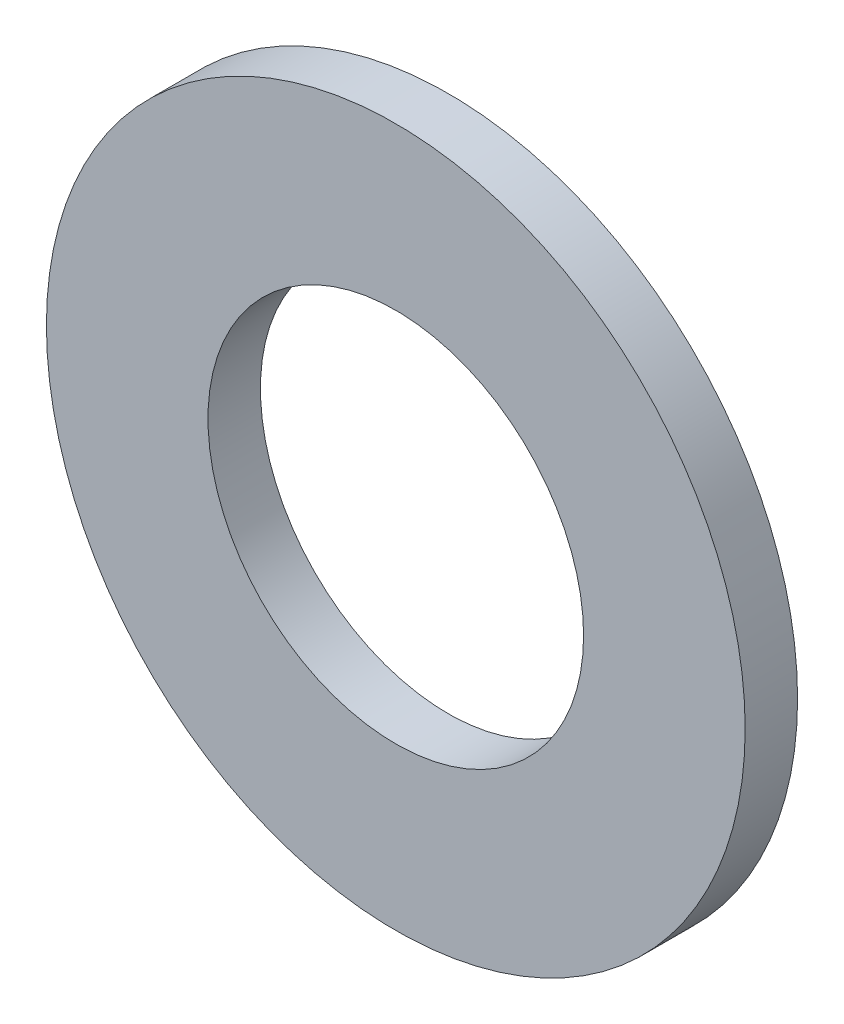
ISO-10303-21;
HEADER;
FILE_DESCRIPTION(('STEP AP214'),'2;1');
FILE_NAME('part.step','',(''),(''),'','','');
FILE_SCHEMA(('AUTOMOTIVE_DESIGN { 1 0 10303 214 1 1 1 1 }'));
ENDSEC;
DATA;
#1=APPLICATION_CONTEXT('core data for automotive mechanical design processes');
#2=APPLICATION_PROTOCOL_DEFINITION('international standard','automotive_design',2000,#1);
#3=PRODUCT_CONTEXT('',#1,'mechanical');
#4=PRODUCT('Part','Part','',(#3));
#5=PRODUCT_RELATED_PRODUCT_CATEGORY('part','',(#4));
#6=PRODUCT_DEFINITION_FORMATION('','',#4);
#7=PRODUCT_DEFINITION_CONTEXT('part definition',#1,'design');
#8=PRODUCT_DEFINITION('design','',#6,#7);
#9=PRODUCT_DEFINITION_SHAPE('','',#8);
#10=(LENGTH_UNIT() NAMED_UNIT(*) SI_UNIT(.MILLI.,.METRE.));
#11=(NAMED_UNIT(*) PLANE_ANGLE_UNIT() SI_UNIT($,.RADIAN.));
#12=(NAMED_UNIT(*) SI_UNIT($,.STERADIAN.) SOLID_ANGLE_UNIT());
#13=UNCERTAINTY_MEASURE_WITH_UNIT(LENGTH_MEASURE(1.E-05),#10,'distance_accuracy_value','');
#14=(GEOMETRIC_REPRESENTATION_CONTEXT(3) GLOBAL_UNCERTAINTY_ASSIGNED_CONTEXT((#13)) GLOBAL_UNIT_ASSIGNED_CONTEXT((#10,
#11,#12)) REPRESENTATION_CONTEXT('',''));
#15=CARTESIAN_POINT('',(0.,0.,0.));
#16=DIRECTION('',(0.,0.,1.));
#17=DIRECTION('',(1.,0.,0.));
#18=AXIS2_PLACEMENT_3D('',#15,#16,#17);
#19=CARTESIAN_POINT('',(0.,0.,0.299999999999999));
#20=DIRECTION('',(0.,0.,1.));
#21=DIRECTION('',(1.,0.,0.));
#22=AXIS2_PLACEMENT_3D('',#19,#20,#21);
#23=PLANE('',#22);
#24=CARTESIAN_POINT('',(0.,0.,0.299999999999999));
#25=DIRECTION('',(0.,0.,1.));
#26=DIRECTION('',(1.,0.,0.));
#27=AXIS2_PLACEMENT_3D('',#24,#25,#26);
#28=CIRCLE('',#27,4.);
#29=CARTESIAN_POINT('',(4.,0.,0.299999999999999));
#30=VERTEX_POINT('',#29);
#31=EDGE_CURVE('E10',#30,#30,#28,.T.);
#32=ORIENTED_EDGE('',*,*,#31,.T.);
#33=EDGE_LOOP('',(#32));
#34=FACE_BOUND('',#33,.T.);
#35=CARTESIAN_POINT('',(0.,0.,0.299999999999999));
#36=DIRECTION('',(0.,0.,1.));
#37=DIRECTION('',(1.,0.,0.));
#38=AXIS2_PLACEMENT_3D('',#35,#36,#37);
#39=CIRCLE('',#38,2.15);
#40=CARTESIAN_POINT('',(2.15,0.,0.299999999999999));
#41=VERTEX_POINT('',#40);
#42=EDGE_CURVE('E37',#41,#41,#39,.T.);
#43=ORIENTED_EDGE('',*,*,#42,.F.);
#44=EDGE_LOOP('',(#43));
#45=FACE_BOUND('',#44,.T.);
#46=ADVANCED_FACE('F30',(#34,#45),#23,.T.);
#47=CARTESIAN_POINT('',(0.,0.,0.299999999999999));
#48=DIRECTION('',(0.,0.,-1.));
#49=DIRECTION('',(-1.,0.,0.));
#50=AXIS2_PLACEMENT_3D('',#47,#48,#49);
#51=CYLINDRICAL_SURFACE('',#50,4.);
#52=ORIENTED_EDGE('',*,*,#31,.F.);
#53=EDGE_LOOP('',(#52));
#54=FACE_BOUND('',#53,.T.);
#55=CARTESIAN_POINT('',(0.,0.,-0.300000000000001));
#56=DIRECTION('',(0.,0.,1.));
#57=DIRECTION('',(1.,0.,0.));
#58=AXIS2_PLACEMENT_3D('',#55,#56,#57);
#59=CIRCLE('',#58,4.);
#60=CARTESIAN_POINT('',(4.,0.,-0.300000000000001));
#61=VERTEX_POINT('',#60);
#62=EDGE_CURVE('E41',#61,#61,#59,.T.);
#63=ORIENTED_EDGE('',*,*,#62,.T.);
#64=EDGE_LOOP('',(#63));
#65=FACE_BOUND('',#64,.T.);
#66=ADVANCED_FACE('F32',(#54,#65),#51,.T.);
#67=CARTESIAN_POINT('',(0.,0.,0.299999999999999));
#68=DIRECTION('',(0.,0.,-1.));
#69=DIRECTION('',(-1.,0.,0.));
#70=AXIS2_PLACEMENT_3D('',#67,#68,#69);
#71=CYLINDRICAL_SURFACE('',#70,2.15);
#72=ORIENTED_EDGE('',*,*,#42,.T.);
#73=EDGE_LOOP('',(#72));
#74=FACE_BOUND('',#73,.T.);
#75=CARTESIAN_POINT('',(0.,0.,-0.300000000000001));
#76=DIRECTION('',(0.,0.,1.));
#77=DIRECTION('',(1.,0.,0.));
#78=AXIS2_PLACEMENT_3D('',#75,#76,#77);
#79=CIRCLE('',#78,2.15);
#80=CARTESIAN_POINT('',(2.15,0.,-0.300000000000001));
#81=VERTEX_POINT('',#80);
#82=EDGE_CURVE('E45',#81,#81,#79,.T.);
#83=ORIENTED_EDGE('',*,*,#82,.F.);
#84=EDGE_LOOP('',(#83));
#85=FACE_BOUND('',#84,.T.);
#86=ADVANCED_FACE('F54',(#74,#85),#71,.F.);
#87=CARTESIAN_POINT('',(0.,0.,-0.300000000000001));
#88=DIRECTION('',(0.,0.,1.));
#89=DIRECTION('',(1.,0.,0.));
#90=AXIS2_PLACEMENT_3D('',#87,#88,#89);
#91=PLANE('',#90);
#92=ORIENTED_EDGE('',*,*,#82,.T.);
#93=EDGE_LOOP('',(#92));
#94=FACE_BOUND('',#93,.T.);
#95=ORIENTED_EDGE('',*,*,#62,.F.);
#96=EDGE_LOOP('',(#95));
#97=FACE_BOUND('',#96,.T.);
#98=ADVANCED_FACE('F51',(#94,#97),#91,.F.);
#99=CLOSED_SHELL('',(#46,#66,#86,#98));
#100=MANIFOLD_SOLID_BREP('B2',#99);
#101=ADVANCED_BREP_SHAPE_REPRESENTATION('',(#18,#100),#14);
#102=SHAPE_DEFINITION_REPRESENTATION(#9,#101);
ENDSEC;
END-ISO-10303-21;
